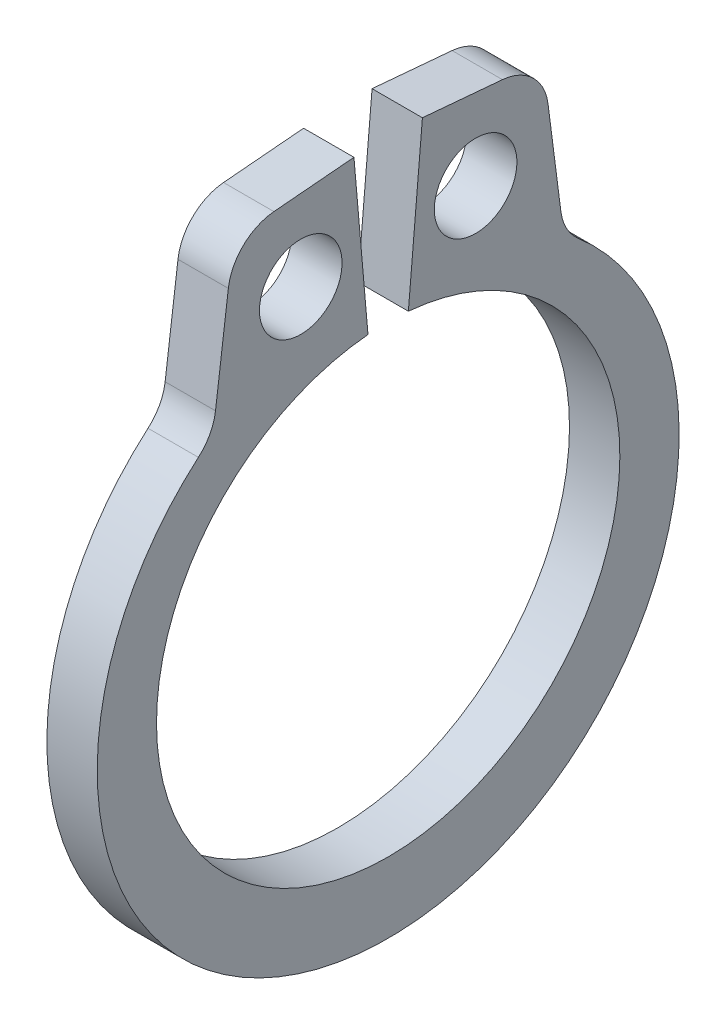
ISO-10303-21;
HEADER;
FILE_DESCRIPTION(('STEP AP214'),'2;1');
FILE_NAME('part.step','',(''),(''),'','','');
FILE_SCHEMA(('AUTOMOTIVE_DESIGN { 1 0 10303 214 1 1 1 1 }'));
ENDSEC;
DATA;
#1=APPLICATION_CONTEXT('core data for automotive mechanical design processes');
#2=APPLICATION_PROTOCOL_DEFINITION('international standard','automotive_design',2000,#1);
#3=PRODUCT_CONTEXT('',#1,'mechanical');
#4=PRODUCT('Part','Part','',(#3));
#5=PRODUCT_RELATED_PRODUCT_CATEGORY('part','',(#4));
#6=PRODUCT_DEFINITION_FORMATION('','',#4);
#7=PRODUCT_DEFINITION_CONTEXT('part definition',#1,'design');
#8=PRODUCT_DEFINITION('design','',#6,#7);
#9=PRODUCT_DEFINITION_SHAPE('','',#8);
#10=(LENGTH_UNIT() NAMED_UNIT(*) SI_UNIT(.MILLI.,.METRE.));
#11=(NAMED_UNIT(*) PLANE_ANGLE_UNIT() SI_UNIT($,.RADIAN.));
#12=(NAMED_UNIT(*) SI_UNIT($,.STERADIAN.) SOLID_ANGLE_UNIT());
#13=UNCERTAINTY_MEASURE_WITH_UNIT(LENGTH_MEASURE(1.E-05),#10,'distance_accuracy_value','');
#14=(GEOMETRIC_REPRESENTATION_CONTEXT(3) GLOBAL_UNCERTAINTY_ASSIGNED_CONTEXT((#13)) GLOBAL_UNIT_ASSIGNED_CONTEXT((#10,
#11,#12)) REPRESENTATION_CONTEXT('',''));
#15=CARTESIAN_POINT('',(0.,0.,0.));
#16=DIRECTION('',(0.,0.,1.));
#17=DIRECTION('',(1.,0.,0.));
#18=AXIS2_PLACEMENT_3D('',#15,#16,#17);
#19=CARTESIAN_POINT('',(-0.3175,0.,0.));
#20=DIRECTION('',(1.,0.,0.));
#21=DIRECTION('',(0.,0.,-1.));
#22=AXIS2_PLACEMENT_3D('',#19,#20,#21);
#23=PLANE('',#22);
#24=CARTESIAN_POINT('',(-0.3175,3.85560585041349,-1.10223251914344));
#25=DIRECTION('',(-1.,0.,0.));
#26=DIRECTION('',(0.,0.,1.));
#27=AXIS2_PLACEMENT_3D('',#24,#25,#26);
#28=CIRCLE('',#27,0.5207);
#29=CARTESIAN_POINT('',(-0.3175,3.85560585041349,-0.581532519143441));
#30=VERTEX_POINT('',#29);
#31=EDGE_CURVE('E133',#30,#30,#28,.F.);
#32=ORIENTED_EDGE('',*,*,#31,.T.);
#33=EDGE_LOOP('',(#32));
#34=FACE_BOUND('',#33,.T.);
#35=CARTESIAN_POINT('',(-0.3175,4.21328151857243,1.38546567126182));
#36=DIRECTION('',(-1.,0.,0.));
#37=DIRECTION('',(0.,0.,1.));
#38=AXIS2_PLACEMENT_3D('',#35,#36,#37);
#39=CIRCLE('',#38,0.635);
#40=CARTESIAN_POINT('',(-0.3175,4.84586515186069,1.44080956790658));
#41=VERTEX_POINT('',#40);
#42=CARTESIAN_POINT('',(-0.3175,4.2945067237745,2.01524933732492));
#43=VERTEX_POINT('',#42);
#44=EDGE_CURVE('E103',#41,#43,#39,.F.);
#45=ORIENTED_EDGE('',*,*,#44,.F.);
#46=DIRECTION('',(0.,0.0871557427476587,-0.996194698091746));
#47=VECTOR('',#46,1.);
#48=CARTESIAN_POINT('',(-0.3175,4.93415233964842,0.431682393829152));
#49=LINE('',#48,#47);
#50=CARTESIAN_POINT('',(-0.3175,4.93415233964842,0.431682393829152));
#51=VERTEX_POINT('',#50);
#52=EDGE_CURVE('E98',#41,#51,#49,.T.);
#53=ORIENTED_EDGE('',*,*,#52,.T.);
#54=DIRECTION('',(0.,-0.996194698091746,-0.0871557427476584));
#55=VECTOR('',#54,1.);
#56=CARTESIAN_POINT('',(-0.3175,2.90988471312599,0.25458192456591));
#57=LINE('',#56,#55);
#58=CARTESIAN_POINT('',(-0.3175,2.90988471312599,0.25458192456591));
#59=VERTEX_POINT('',#58);
#60=EDGE_CURVE('E130',#51,#59,#57,.T.);
#61=ORIENTED_EDGE('',*,*,#60,.T.);
#62=CARTESIAN_POINT('',(-0.3175,0.,0.));
#63=DIRECTION('',(-1.,0.,0.));
#64=DIRECTION('',(0.,0.,1.));
#65=AXIS2_PLACEMENT_3D('',#62,#63,#64);
#66=CIRCLE('',#65,2.921);
#67=CARTESIAN_POINT('',(-0.3175,2.90988471312599,-0.25458192456591));
#68=VERTEX_POINT('',#67);
#69=EDGE_CURVE('E180',#59,#68,#66,.F.);
#70=ORIENTED_EDGE('',*,*,#69,.T.);
#71=DIRECTION('',(0.,0.996194698091746,-0.0871557427476584));
#72=VECTOR('',#71,1.);
#73=CARTESIAN_POINT('',(-0.3175,2.90988471312599,-0.25458192456591));
#74=LINE('',#73,#72);
#75=CARTESIAN_POINT('',(-0.3175,4.93415233964842,-0.431682393829152));
#76=VERTEX_POINT('',#75);
#77=EDGE_CURVE('E140',#68,#76,#74,.T.);
#78=ORIENTED_EDGE('',*,*,#77,.T.);
#79=DIRECTION('',(0.,-0.0871557427476587,-0.996194698091746));
#80=VECTOR('',#79,1.);
#81=CARTESIAN_POINT('',(-0.3175,4.93415233964842,-0.431682393829152));
#82=LINE('',#81,#80);
#83=CARTESIAN_POINT('',(-0.3175,4.84586515186069,-1.44080956790658));
#84=VERTEX_POINT('',#83);
#85=EDGE_CURVE('E147',#76,#84,#82,.T.);
#86=ORIENTED_EDGE('',*,*,#85,.T.);
#87=CARTESIAN_POINT('',(-0.3175,4.21328151857243,-1.38546567126182));
#88=DIRECTION('',(-1.,0.,0.));
#89=DIRECTION('',(0.,0.,1.));
#90=AXIS2_PLACEMENT_3D('',#87,#88,#89);
#91=CIRCLE('',#90,0.635);
#92=CARTESIAN_POINT('',(-0.3175,4.2945067237745,-2.01524933732492));
#93=VERTEX_POINT('',#92);
#94=EDGE_CURVE('E150',#93,#84,#91,.F.);
#95=ORIENTED_EDGE('',*,*,#94,.F.);
#96=DIRECTION('',(0.,-0.991785300886776,-0.127913708979639));
#97=VECTOR('',#96,1.);
#98=CARTESIAN_POINT('',(-0.3175,4.80132698770098,-1.94988311372097));
#99=LINE('',#98,#97);
#100=CARTESIAN_POINT('',(-0.3175,3.03853740820642,-2.17723570007429));
#101=VERTEX_POINT('',#100);
#102=EDGE_CURVE('E153',#93,#101,#99,.T.);
#103=ORIENTED_EDGE('',*,*,#102,.T.);
#104=CARTESIAN_POINT('',(-0.3175,3.11976261340849,-2.80701936613739));
#105=DIRECTION('',(-1.,0.,0.));
#106=DIRECTION('',(0.,0.,1.));
#107=AXIS2_PLACEMENT_3D('',#104,#105,#106);
#108=CIRCLE('',#107,0.635);
#109=CARTESIAN_POINT('',(-0.3175,2.63846487393826,-2.39280023816181));
#110=VERTEX_POINT('',#109);
#111=EDGE_CURVE('E186',#101,#110,#108,.F.);
#112=ORIENTED_EDGE('',*,*,#111,.T.);
#113=CARTESIAN_POINT('',(-0.3175,-0.141825237867011,0.));
#114=DIRECTION('',(-1.,0.,0.));
#115=DIRECTION('',(0.,0.,1.));
#116=AXIS2_PLACEMENT_3D('',#113,#114,#115);
#117=CIRCLE('',#116,3.66817476213299);
#118=CARTESIAN_POINT('',(-0.3175,2.63846487393826,2.39280023816181));
#119=VERTEX_POINT('',#118);
#120=EDGE_CURVE('E188',#119,#110,#117,.F.);
#121=ORIENTED_EDGE('',*,*,#120,.F.);
#122=CARTESIAN_POINT('',(-0.3175,3.11976261340849,2.80701936613739));
#123=DIRECTION('',(-1.,0.,0.));
#124=DIRECTION('',(0.,0.,1.));
#125=AXIS2_PLACEMENT_3D('',#122,#123,#124);
#126=CIRCLE('',#125,0.635);
#127=CARTESIAN_POINT('',(-0.3175,3.03853740820642,2.17723570007429));
#128=VERTEX_POINT('',#127);
#129=EDGE_CURVE('E116',#119,#128,#126,.F.);
#130=ORIENTED_EDGE('',*,*,#129,.T.);
#131=DIRECTION('',(0.,0.991785300886776,-0.127913708979639));
#132=VECTOR('',#131,1.);
#133=CARTESIAN_POINT('',(-0.3175,4.80132698770098,1.94988311372097));
#134=LINE('',#133,#132);
#135=EDGE_CURVE('E113',#128,#43,#134,.T.);
#136=ORIENTED_EDGE('',*,*,#135,.T.);
#137=EDGE_LOOP('',(#45,#53,#61,#70,#78,#86,#95,#103,#112,#121,#130,#136));
#138=FACE_BOUND('',#137,.T.);
#139=CARTESIAN_POINT('',(-0.3175,3.85560585041349,1.10223251914344));
#140=DIRECTION('',(-1.,0.,0.));
#141=DIRECTION('',(0.,0.,1.));
#142=AXIS2_PLACEMENT_3D('',#139,#140,#141);
#143=CIRCLE('',#142,0.5207);
#144=CARTESIAN_POINT('',(-0.3175,3.85560585041349,1.62293251914344));
#145=VERTEX_POINT('',#144);
#146=EDGE_CURVE('E20',#145,#145,#143,.F.);
#147=ORIENTED_EDGE('',*,*,#146,.T.);
#148=EDGE_LOOP('',(#147));
#149=FACE_BOUND('',#148,.T.);
#150=ADVANCED_FACE('F17',(#34,#138,#149),#23,.F.);
#151=CARTESIAN_POINT('',(0.3175,3.85560585041349,1.10223251914344));
#152=DIRECTION('',(-1.,0.,0.));
#153=DIRECTION('',(0.,0.,1.));
#154=AXIS2_PLACEMENT_3D('',#151,#152,#153);
#155=CYLINDRICAL_SURFACE('',#154,0.5207);
#156=CARTESIAN_POINT('',(0.3175,3.85560585041349,1.10223251914344));
#157=DIRECTION('',(-1.,0.,0.));
#158=DIRECTION('',(0.,0.,1.));
#159=AXIS2_PLACEMENT_3D('',#156,#157,#158);
#160=CIRCLE('',#159,0.5207);
#161=CARTESIAN_POINT('',(0.3175,3.85560585041349,1.62293251914344));
#162=VERTEX_POINT('',#161);
#163=EDGE_CURVE('E175',#162,#162,#160,.T.);
#164=ORIENTED_EDGE('',*,*,#163,.F.);
#165=EDGE_LOOP('',(#164));
#166=FACE_BOUND('',#165,.T.);
#167=ORIENTED_EDGE('',*,*,#146,.F.);
#168=EDGE_LOOP('',(#167));
#169=FACE_BOUND('',#168,.T.);
#170=ADVANCED_FACE('F388',(#166,#169),#155,.F.);
#171=CARTESIAN_POINT('',(0.3175,4.93415233964842,0.431682393829152));
#172=DIRECTION('',(0.,-0.996194698091746,-0.0871557427476587));
#173=DIRECTION('',(0.,0.0871557427476587,-0.996194698091746));
#174=AXIS2_PLACEMENT_3D('',#171,#172,#173);
#175=PLANE('',#174);
#176=DIRECTION('',(-1.,0.,0.));
#177=VECTOR('',#176,1.);
#178=CARTESIAN_POINT('',(0.3175,4.84586515186069,1.44080956790658));
#179=LINE('',#178,#177);
#180=CARTESIAN_POINT('',(0.3175,4.84586515186069,1.44080956790658));
#181=VERTEX_POINT('',#180);
#182=EDGE_CURVE('E110',#181,#41,#179,.T.);
#183=ORIENTED_EDGE('',*,*,#182,.F.);
#184=DIRECTION('',(0.,-0.0871557427476588,0.996194698091746));
#185=VECTOR('',#184,1.);
#186=CARTESIAN_POINT('',(0.3175,4.93415233964842,0.431682393829152));
#187=LINE('',#186,#185);
#188=CARTESIAN_POINT('',(0.3175,4.93415233964842,0.431682393829152));
#189=VERTEX_POINT('',#188);
#190=EDGE_CURVE('E174',#189,#181,#187,.T.);
#191=ORIENTED_EDGE('',*,*,#190,.F.);
#192=DIRECTION('',(1.,0.,0.));
#193=VECTOR('',#192,1.);
#194=CARTESIAN_POINT('',(0.3175,4.93415233964842,0.431682393829152));
#195=LINE('',#194,#193);
#196=EDGE_CURVE('E134',#189,#51,#195,.F.);
#197=ORIENTED_EDGE('',*,*,#196,.T.);
#198=ORIENTED_EDGE('',*,*,#52,.F.);
#199=EDGE_LOOP('',(#183,#191,#197,#198));
#200=FACE_BOUND('',#199,.T.);
#201=ADVANCED_FACE('F238',(#200),#175,.F.);
#202=CARTESIAN_POINT('',(0.3175,4.21328151857243,1.38546567126182));
#203=DIRECTION('',(-1.,0.,0.));
#204=DIRECTION('',(0.,0.,1.));
#205=AXIS2_PLACEMENT_3D('',#202,#203,#204);
#206=CYLINDRICAL_SURFACE('',#205,0.635);
#207=ORIENTED_EDGE('',*,*,#44,.T.);
#208=DIRECTION('',(1.,0.,0.));
#209=VECTOR('',#208,1.);
#210=CARTESIAN_POINT('',(0.3175,4.2945067237745,2.01524933732492));
#211=LINE('',#210,#209);
#212=CARTESIAN_POINT('',(0.3175,4.2945067237745,2.01524933732492));
#213=VERTEX_POINT('',#212);
#214=EDGE_CURVE('E108',#43,#213,#211,.T.);
#215=ORIENTED_EDGE('',*,*,#214,.T.);
#216=CARTESIAN_POINT('',(0.3175,4.21328151857243,1.38546567126182));
#217=DIRECTION('',(-1.,0.,0.));
#218=DIRECTION('',(0.,0.,1.));
#219=AXIS2_PLACEMENT_3D('',#216,#217,#218);
#220=CIRCLE('',#219,0.635);
#221=EDGE_CURVE('E172',#181,#213,#220,.F.);
#222=ORIENTED_EDGE('',*,*,#221,.F.);
#223=ORIENTED_EDGE('',*,*,#182,.T.);
#224=EDGE_LOOP('',(#207,#215,#222,#223));
#225=FACE_BOUND('',#224,.T.);
#226=ADVANCED_FACE('F105',(#225),#206,.T.);
#227=CARTESIAN_POINT('',(0.3175,4.80132698770098,1.94988311372097));
#228=DIRECTION('',(0.,-0.127913708979639,-0.991785300886776));
#229=DIRECTION('',(0.,0.991785300886776,-0.127913708979639));
#230=AXIS2_PLACEMENT_3D('',#227,#228,#229);
#231=PLANE('',#230);
#232=DIRECTION('',(-1.,0.,0.));
#233=VECTOR('',#232,1.);
#234=CARTESIAN_POINT('',(0.3175,3.03853740820642,2.17723570007429));
#235=LINE('',#234,#233);
#236=CARTESIAN_POINT('',(0.3175,3.03853740820642,2.17723570007429));
#237=VERTEX_POINT('',#236);
#238=EDGE_CURVE('E127',#128,#237,#235,.F.);
#239=ORIENTED_EDGE('',*,*,#238,.T.);
#240=DIRECTION('',(0.,-0.991785300886776,0.127913708979639));
#241=VECTOR('',#240,1.);
#242=CARTESIAN_POINT('',(0.3175,4.2945067237745,2.01524933732492));
#243=LINE('',#242,#241);
#244=EDGE_CURVE('E122',#213,#237,#243,.T.);
#245=ORIENTED_EDGE('',*,*,#244,.F.);
#246=ORIENTED_EDGE('',*,*,#214,.F.);
#247=ORIENTED_EDGE('',*,*,#135,.F.);
#248=EDGE_LOOP('',(#239,#245,#246,#247));
#249=FACE_BOUND('',#248,.T.);
#250=ADVANCED_FACE('F120',(#249),#231,.F.);
#251=CARTESIAN_POINT('',(0.3175,3.11976261340849,2.80701936613739));
#252=DIRECTION('',(-1.,0.,0.));
#253=DIRECTION('',(0.,0.,1.));
#254=AXIS2_PLACEMENT_3D('',#251,#252,#253);
#255=CYLINDRICAL_SURFACE('',#254,0.635);
#256=ORIENTED_EDGE('',*,*,#238,.F.);
#257=ORIENTED_EDGE('',*,*,#129,.F.);
#258=DIRECTION('',(-1.,0.,0.));
#259=VECTOR('',#258,1.);
#260=CARTESIAN_POINT('',(0.3175,2.63846487393826,2.39280023816181));
#261=LINE('',#260,#259);
#262=CARTESIAN_POINT('',(0.3175,2.63846487393826,2.39280023816181));
#263=VERTEX_POINT('',#262);
#264=EDGE_CURVE('E191',#263,#119,#261,.T.);
#265=ORIENTED_EDGE('',*,*,#264,.F.);
#266=CARTESIAN_POINT('',(0.3175,3.11976261340849,2.80701936613739));
#267=DIRECTION('',(-1.,0.,0.));
#268=DIRECTION('',(0.,0.,1.));
#269=AXIS2_PLACEMENT_3D('',#266,#267,#268);
#270=CIRCLE('',#269,0.635);
#271=EDGE_CURVE('E169',#237,#263,#270,.T.);
#272=ORIENTED_EDGE('',*,*,#271,.F.);
#273=EDGE_LOOP('',(#256,#257,#265,#272));
#274=FACE_BOUND('',#273,.T.);
#275=ADVANCED_FACE('F268',(#274),#255,.F.);
#276=CARTESIAN_POINT('',(0.3175,-0.141825237867011,0.));
#277=DIRECTION('',(-1.,0.,0.));
#278=DIRECTION('',(0.,0.,1.));
#279=AXIS2_PLACEMENT_3D('',#276,#277,#278);
#280=CYLINDRICAL_SURFACE('',#279,3.66817476213299);
#281=ORIENTED_EDGE('',*,*,#120,.T.);
#282=DIRECTION('',(-1.,0.,0.));
#283=VECTOR('',#282,1.);
#284=CARTESIAN_POINT('',(0.3175,2.63846487393826,-2.39280023816181));
#285=LINE('',#284,#283);
#286=CARTESIAN_POINT('',(0.3175,2.63846487393826,-2.39280023816181));
#287=VERTEX_POINT('',#286);
#288=EDGE_CURVE('E155',#110,#287,#285,.F.);
#289=ORIENTED_EDGE('',*,*,#288,.T.);
#290=CARTESIAN_POINT('',(0.3175,-0.141825237867011,0.));
#291=DIRECTION('',(-1.,0.,0.));
#292=DIRECTION('',(0.,0.,1.));
#293=AXIS2_PLACEMENT_3D('',#290,#291,#292);
#294=CIRCLE('',#293,3.66817476213299);
#295=EDGE_CURVE('E167',#263,#287,#294,.F.);
#296=ORIENTED_EDGE('',*,*,#295,.F.);
#297=ORIENTED_EDGE('',*,*,#264,.T.);
#298=EDGE_LOOP('',(#281,#289,#296,#297));
#299=FACE_BOUND('',#298,.T.);
#300=ADVANCED_FACE('F266',(#299),#280,.T.);
#301=CARTESIAN_POINT('',(0.3175,3.11976261340849,-2.80701936613739));
#302=DIRECTION('',(-1.,0.,0.));
#303=DIRECTION('',(0.,0.,1.));
#304=AXIS2_PLACEMENT_3D('',#301,#302,#303);
#305=CYLINDRICAL_SURFACE('',#304,0.635);
#306=ORIENTED_EDGE('',*,*,#288,.F.);
#307=ORIENTED_EDGE('',*,*,#111,.F.);
#308=DIRECTION('',(1.,0.,0.));
#309=VECTOR('',#308,1.);
#310=CARTESIAN_POINT('',(0.3175,3.03853740820642,-2.17723570007429));
#311=LINE('',#310,#309);
#312=CARTESIAN_POINT('',(0.3175,3.03853740820642,-2.17723570007429));
#313=VERTEX_POINT('',#312);
#314=EDGE_CURVE('E154',#101,#313,#311,.T.);
#315=ORIENTED_EDGE('',*,*,#314,.T.);
#316=CARTESIAN_POINT('',(0.3175,3.11976261340849,-2.80701936613739));
#317=DIRECTION('',(-1.,0.,0.));
#318=DIRECTION('',(0.,0.,1.));
#319=AXIS2_PLACEMENT_3D('',#316,#317,#318);
#320=CIRCLE('',#319,0.635);
#321=EDGE_CURVE('E164',#287,#313,#320,.T.);
#322=ORIENTED_EDGE('',*,*,#321,.F.);
#323=EDGE_LOOP('',(#306,#307,#315,#322));
#324=FACE_BOUND('',#323,.T.);
#325=ADVANCED_FACE('F264',(#324),#305,.F.);
#326=CARTESIAN_POINT('',(0.3175,4.80132698770098,-1.94988311372097));
#327=DIRECTION('',(0.,-0.127913708979639,0.991785300886776));
#328=DIRECTION('',(0.,-0.991785300886776,-0.127913708979639));
#329=AXIS2_PLACEMENT_3D('',#326,#327,#328);
#330=PLANE('',#329);
#331=ORIENTED_EDGE('',*,*,#314,.F.);
#332=ORIENTED_EDGE('',*,*,#102,.F.);
#333=DIRECTION('',(-1.,0.,0.));
#334=VECTOR('',#333,1.);
#335=CARTESIAN_POINT('',(0.3175,4.2945067237745,-2.01524933732492));
#336=LINE('',#335,#334);
#337=CARTESIAN_POINT('',(0.3175,4.2945067237745,-2.01524933732492));
#338=VERTEX_POINT('',#337);
#339=EDGE_CURVE('E185',#338,#93,#336,.T.);
#340=ORIENTED_EDGE('',*,*,#339,.F.);
#341=DIRECTION('',(0.,0.991785300886776,0.127913708979639));
#342=VECTOR('',#341,1.);
#343=CARTESIAN_POINT('',(0.3175,3.03853740820642,-2.17723570007429));
#344=LINE('',#343,#342);
#345=EDGE_CURVE('E163',#313,#338,#344,.T.);
#346=ORIENTED_EDGE('',*,*,#345,.F.);
#347=EDGE_LOOP('',(#331,#332,#340,#346));
#348=FACE_BOUND('',#347,.T.);
#349=ADVANCED_FACE('F260',(#348),#330,.F.);
#350=CARTESIAN_POINT('',(0.3175,4.21328151857243,-1.38546567126182));
#351=DIRECTION('',(-1.,0.,0.));
#352=DIRECTION('',(0.,0.,1.));
#353=AXIS2_PLACEMENT_3D('',#350,#351,#352);
#354=CYLINDRICAL_SURFACE('',#353,0.635);
#355=ORIENTED_EDGE('',*,*,#94,.T.);
#356=DIRECTION('',(1.,0.,0.));
#357=VECTOR('',#356,1.);
#358=CARTESIAN_POINT('',(0.3175,4.84586515186069,-1.44080956790658));
#359=LINE('',#358,#357);
#360=CARTESIAN_POINT('',(0.3175,4.84586515186069,-1.44080956790658));
#361=VERTEX_POINT('',#360);
#362=EDGE_CURVE('E149',#84,#361,#359,.T.);
#363=ORIENTED_EDGE('',*,*,#362,.T.);
#364=CARTESIAN_POINT('',(0.3175,4.21328151857243,-1.38546567126182));
#365=DIRECTION('',(-1.,0.,0.));
#366=DIRECTION('',(0.,0.,1.));
#367=AXIS2_PLACEMENT_3D('',#364,#365,#366);
#368=CIRCLE('',#367,0.635);
#369=EDGE_CURVE('E159',#338,#361,#368,.F.);
#370=ORIENTED_EDGE('',*,*,#369,.F.);
#371=ORIENTED_EDGE('',*,*,#339,.T.);
#372=EDGE_LOOP('',(#355,#363,#370,#371));
#373=FACE_BOUND('',#372,.T.);
#374=ADVANCED_FACE('F255',(#373),#354,.T.);
#375=CARTESIAN_POINT('',(0.3175,4.93415233964842,-0.431682393829152));
#376=DIRECTION('',(0.,-0.996194698091746,0.0871557427476587));
#377=DIRECTION('',(0.,-0.0871557427476587,-0.996194698091746));
#378=AXIS2_PLACEMENT_3D('',#375,#376,#377);
#379=PLANE('',#378);
#380=ORIENTED_EDGE('',*,*,#362,.F.);
#381=ORIENTED_EDGE('',*,*,#85,.F.);
#382=DIRECTION('',(1.,0.,0.));
#383=VECTOR('',#382,1.);
#384=CARTESIAN_POINT('',(0.3175,4.93415233964842,-0.431682393829152));
#385=LINE('',#384,#383);
#386=CARTESIAN_POINT('',(0.3175,4.93415233964842,-0.431682393829152));
#387=VERTEX_POINT('',#386);
#388=EDGE_CURVE('E144',#76,#387,#385,.T.);
#389=ORIENTED_EDGE('',*,*,#388,.T.);
#390=DIRECTION('',(0.,0.0871557427476588,0.996194698091746));
#391=VECTOR('',#390,1.);
#392=CARTESIAN_POINT('',(0.3175,4.84586515186069,-1.44080956790658));
#393=LINE('',#392,#391);
#394=EDGE_CURVE('E162',#361,#387,#393,.T.);
#395=ORIENTED_EDGE('',*,*,#394,.F.);
#396=EDGE_LOOP('',(#380,#381,#389,#395));
#397=FACE_BOUND('',#396,.T.);
#398=ADVANCED_FACE('F252',(#397),#379,.F.);
#399=CARTESIAN_POINT('',(0.3175,2.90988471312599,-0.25458192456591));
#400=DIRECTION('',(0.,-0.0871557427476584,-0.996194698091746));
#401=DIRECTION('',(0.,0.996194698091746,-0.0871557427476584));
#402=AXIS2_PLACEMENT_3D('',#399,#400,#401);
#403=PLANE('',#402);
#404=DIRECTION('',(-1.,0.,0.));
#405=VECTOR('',#404,1.);
#406=CARTESIAN_POINT('',(0.3175,2.90988471312599,-0.25458192456591));
#407=LINE('',#406,#405);
#408=CARTESIAN_POINT('',(0.3175,2.90988471312599,-0.25458192456591));
#409=VERTEX_POINT('',#408);
#410=EDGE_CURVE('E143',#68,#409,#407,.F.);
#411=ORIENTED_EDGE('',*,*,#410,.T.);
#412=DIRECTION('',(0.,-0.996194698091746,0.0871557427476584));
#413=VECTOR('',#412,1.);
#414=CARTESIAN_POINT('',(0.3175,4.93415233964842,-0.431682393829152));
#415=LINE('',#414,#413);
#416=EDGE_CURVE('E158',#387,#409,#415,.T.);
#417=ORIENTED_EDGE('',*,*,#416,.F.);
#418=ORIENTED_EDGE('',*,*,#388,.F.);
#419=ORIENTED_EDGE('',*,*,#77,.F.);
#420=EDGE_LOOP('',(#411,#417,#418,#419));
#421=FACE_BOUND('',#420,.T.);
#422=ADVANCED_FACE('F244',(#421),#403,.F.);
#423=CARTESIAN_POINT('',(0.3175,0.,0.));
#424=DIRECTION('',(-1.,0.,0.));
#425=DIRECTION('',(0.,0.,1.));
#426=AXIS2_PLACEMENT_3D('',#423,#424,#425);
#427=CYLINDRICAL_SURFACE('',#426,2.921);
#428=DIRECTION('',(1.,0.,0.));
#429=VECTOR('',#428,1.);
#430=CARTESIAN_POINT('',(0.3175,2.90988471312599,0.25458192456591));
#431=LINE('',#430,#429);
#432=CARTESIAN_POINT('',(0.3175,2.90988471312599,0.25458192456591));
#433=VERTEX_POINT('',#432);
#434=EDGE_CURVE('E182',#59,#433,#431,.T.);
#435=ORIENTED_EDGE('',*,*,#434,.T.);
#436=CARTESIAN_POINT('',(0.3175,0.,0.));
#437=DIRECTION('',(-1.,0.,0.));
#438=DIRECTION('',(0.,0.,1.));
#439=AXIS2_PLACEMENT_3D('',#436,#437,#438);
#440=CIRCLE('',#439,2.921);
#441=EDGE_CURVE('E35',#409,#433,#440,.T.);
#442=ORIENTED_EDGE('',*,*,#441,.F.);
#443=ORIENTED_EDGE('',*,*,#410,.F.);
#444=ORIENTED_EDGE('',*,*,#69,.F.);
#445=EDGE_LOOP('',(#435,#442,#443,#444));
#446=FACE_BOUND('',#445,.T.);
#447=ADVANCED_FACE('F246',(#446),#427,.F.);
#448=CARTESIAN_POINT('',(0.3175,2.90988471312599,0.25458192456591));
#449=DIRECTION('',(0.,-0.0871557427476584,0.996194698091746));
#450=DIRECTION('',(0.,-0.996194698091746,-0.0871557427476584));
#451=AXIS2_PLACEMENT_3D('',#448,#449,#450);
#452=PLANE('',#451);
#453=ORIENTED_EDGE('',*,*,#196,.F.);
#454=DIRECTION('',(0.,0.996194698091746,0.0871557427476584));
#455=VECTOR('',#454,1.);
#456=CARTESIAN_POINT('',(0.3175,2.90988471312599,0.25458192456591));
#457=LINE('',#456,#455);
#458=EDGE_CURVE('E26',#433,#189,#457,.T.);
#459=ORIENTED_EDGE('',*,*,#458,.F.);
#460=ORIENTED_EDGE('',*,*,#434,.F.);
#461=ORIENTED_EDGE('',*,*,#60,.F.);
#462=EDGE_LOOP('',(#453,#459,#460,#461));
#463=FACE_BOUND('',#462,.T.);
#464=ADVANCED_FACE('F236',(#463),#452,.F.);
#465=CARTESIAN_POINT('',(0.3175,3.85560585041349,-1.10223251914344));
#466=DIRECTION('',(-1.,0.,0.));
#467=DIRECTION('',(0.,0.,1.));
#468=AXIS2_PLACEMENT_3D('',#465,#466,#467);
#469=CYLINDRICAL_SURFACE('',#468,0.5207);
#470=CARTESIAN_POINT('',(0.3175,3.85560585041349,-1.10223251914344));
#471=DIRECTION('',(-1.,0.,0.));
#472=DIRECTION('',(0.,0.,1.));
#473=AXIS2_PLACEMENT_3D('',#470,#471,#472);
#474=CIRCLE('',#473,0.5207);
#475=CARTESIAN_POINT('',(0.3175,3.85560585041349,-0.581532519143441));
#476=VERTEX_POINT('',#475);
#477=EDGE_CURVE('E11',#476,#476,#474,.T.);
#478=ORIENTED_EDGE('',*,*,#477,.F.);
#479=EDGE_LOOP('',(#478));
#480=FACE_BOUND('',#479,.T.);
#481=ORIENTED_EDGE('',*,*,#31,.F.);
#482=EDGE_LOOP('',(#481));
#483=FACE_BOUND('',#482,.T.);
#484=ADVANCED_FACE('F279',(#480,#483),#469,.F.);
#485=CARTESIAN_POINT('',(0.3175,0.,0.));
#486=DIRECTION('',(1.,0.,0.));
#487=DIRECTION('',(0.,0.,-1.));
#488=AXIS2_PLACEMENT_3D('',#485,#486,#487);
#489=PLANE('',#488);
#490=ORIENTED_EDGE('',*,*,#477,.T.);
#491=EDGE_LOOP('',(#490));
#492=FACE_BOUND('',#491,.T.);
#493=ORIENTED_EDGE('',*,*,#441,.T.);
#494=ORIENTED_EDGE('',*,*,#458,.T.);
#495=ORIENTED_EDGE('',*,*,#190,.T.);
#496=ORIENTED_EDGE('',*,*,#221,.T.);
#497=ORIENTED_EDGE('',*,*,#244,.T.);
#498=ORIENTED_EDGE('',*,*,#271,.T.);
#499=ORIENTED_EDGE('',*,*,#295,.T.);
#500=ORIENTED_EDGE('',*,*,#321,.T.);
#501=ORIENTED_EDGE('',*,*,#345,.T.);
#502=ORIENTED_EDGE('',*,*,#369,.T.);
#503=ORIENTED_EDGE('',*,*,#394,.T.);
#504=ORIENTED_EDGE('',*,*,#416,.T.);
#505=EDGE_LOOP('',(#493,#494,#495,#496,#497,#498,#499,#500,#501,#502,#503,#504));
#506=FACE_BOUND('',#505,.T.);
#507=ORIENTED_EDGE('',*,*,#163,.T.);
#508=EDGE_LOOP('',(#507));
#509=FACE_BOUND('',#508,.T.);
#510=ADVANCED_FACE('F229',(#492,#506,#509),#489,.T.);
#511=CLOSED_SHELL('',(#150,#170,#201,#226,#250,#275,#300,#325,#349,#374,#398,#422,#447,#464,
#484,#510));
#512=MANIFOLD_SOLID_BREP('B1',#511);
#513=ADVANCED_BREP_SHAPE_REPRESENTATION('',(#18,#512),#14);
#514=SHAPE_DEFINITION_REPRESENTATION(#9,#513);
ENDSEC;
END-ISO-10303-21;
